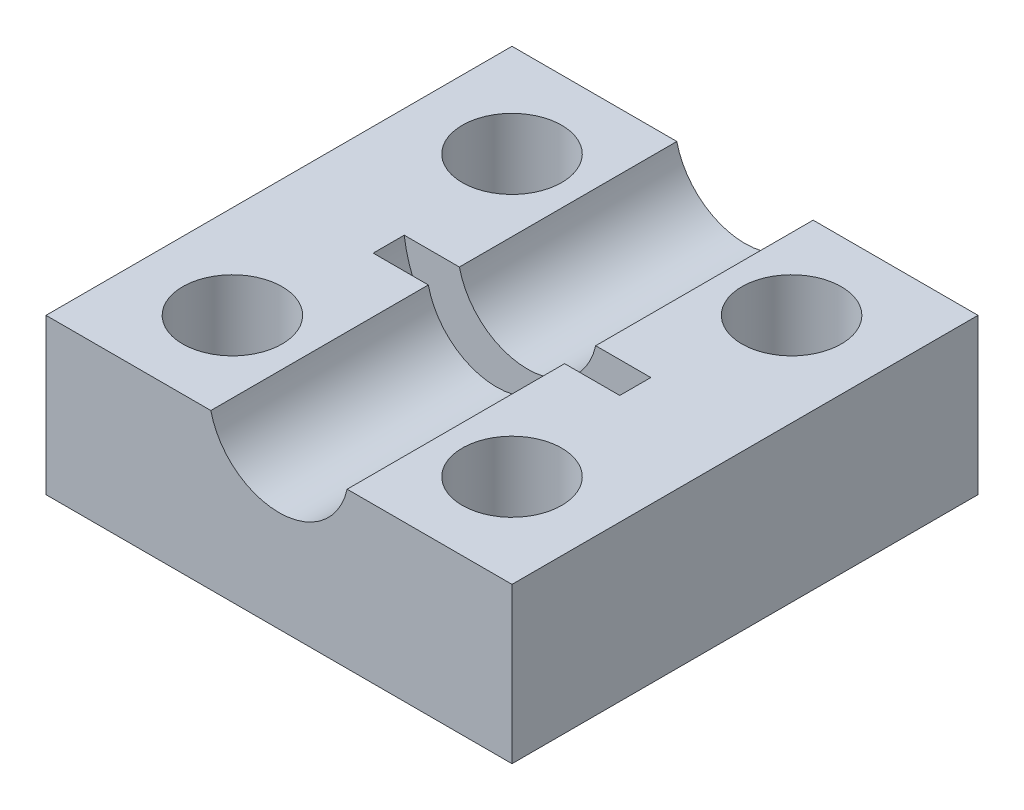
ISO-10303-21;
HEADER;
FILE_DESCRIPTION(('STEP AP214'),'2;1');
FILE_NAME('part.step','',(''),(''),'','','');
FILE_SCHEMA(('AUTOMOTIVE_DESIGN { 1 0 10303 214 1 1 1 1 }'));
ENDSEC;
DATA;
#1=APPLICATION_CONTEXT('core data for automotive mechanical design processes');
#2=APPLICATION_PROTOCOL_DEFINITION('international standard','automotive_design',2000,#1);
#3=PRODUCT_CONTEXT('',#1,'mechanical');
#4=PRODUCT('Part','Part','',(#3));
#5=PRODUCT_RELATED_PRODUCT_CATEGORY('part','',(#4));
#6=PRODUCT_DEFINITION_FORMATION('','',#4);
#7=PRODUCT_DEFINITION_CONTEXT('part definition',#1,'design');
#8=PRODUCT_DEFINITION('design','',#6,#7);
#9=PRODUCT_DEFINITION_SHAPE('','',#8);
#10=(LENGTH_UNIT() NAMED_UNIT(*) SI_UNIT(.MILLI.,.METRE.));
#11=(NAMED_UNIT(*) PLANE_ANGLE_UNIT() SI_UNIT($,.RADIAN.));
#12=(NAMED_UNIT(*) SI_UNIT($,.STERADIAN.) SOLID_ANGLE_UNIT());
#13=UNCERTAINTY_MEASURE_WITH_UNIT(LENGTH_MEASURE(1.E-05),#10,'distance_accuracy_value','');
#14=(GEOMETRIC_REPRESENTATION_CONTEXT(3) GLOBAL_UNCERTAINTY_ASSIGNED_CONTEXT((#13)) GLOBAL_UNIT_ASSIGNED_CONTEXT((#10,
#11,#12)) REPRESENTATION_CONTEXT('',''));
#15=CARTESIAN_POINT('',(0.,0.,0.));
#16=DIRECTION('',(0.,0.,1.));
#17=DIRECTION('',(1.,0.,0.));
#18=AXIS2_PLACEMENT_3D('',#15,#16,#17);
#19=CARTESIAN_POINT('',(0.,5.,0.));
#20=DIRECTION('',(0.,1.,0.));
#21=DIRECTION('',(0.,0.,1.));
#22=AXIS2_PLACEMENT_3D('',#19,#20,#21);
#23=PLANE('',#22);
#24=CARTESIAN_POINT('',(-4.5,5.,4.5));
#25=DIRECTION('',(0.,1.,0.));
#26=DIRECTION('',(0.,0.,1.));
#27=AXIS2_PLACEMENT_3D('',#24,#25,#26);
#28=CIRCLE('',#27,1.6);
#29=CARTESIAN_POINT('',(-4.5,5.,6.1));
#30=VERTEX_POINT('',#29);
#31=EDGE_CURVE('E159',#30,#30,#28,.T.);
#32=ORIENTED_EDGE('',*,*,#31,.F.);
#33=EDGE_LOOP('',(#32));
#34=FACE_BOUND('',#33,.T.);
#35=CARTESIAN_POINT('',(-4.5,5.,-4.5));
#36=DIRECTION('',(0.,1.,0.));
#37=DIRECTION('',(0.,0.,1.));
#38=AXIS2_PLACEMENT_3D('',#35,#36,#37);
#39=CIRCLE('',#38,1.6);
#40=CARTESIAN_POINT('',(-4.5,5.,-2.9));
#41=VERTEX_POINT('',#40);
#42=EDGE_CURVE('E165',#41,#41,#39,.T.);
#43=ORIENTED_EDGE('',*,*,#42,.F.);
#44=EDGE_LOOP('',(#43));
#45=FACE_BOUND('',#44,.T.);
#46=DIRECTION('',(0.,0.,1.));
#47=VECTOR('',#46,1.);
#48=CARTESIAN_POINT('',(-3.96862696659689,5.,-0.500000000000001));
#49=LINE('',#48,#47);
#50=CARTESIAN_POINT('',(-3.96862696659689,5.,-0.500000000000001));
#51=VERTEX_POINT('',#50);
#52=CARTESIAN_POINT('',(-3.96862696659689,5.,0.499999999999999));
#53=VERTEX_POINT('',#52);
#54=EDGE_CURVE('E112',#51,#53,#49,.T.);
#55=ORIENTED_EDGE('',*,*,#54,.F.);
#56=DIRECTION('',(1.,0.,0.));
#57=VECTOR('',#56,1.);
#58=CARTESIAN_POINT('',(0.,5.,-0.500000000000001));
#59=LINE('',#58,#57);
#60=CARTESIAN_POINT('',(-2.19374109684803,5.,-0.500000000000001));
#61=VERTEX_POINT('',#60);
#62=EDGE_CURVE('E121',#51,#61,#59,.T.);
#63=ORIENTED_EDGE('',*,*,#62,.T.);
#64=DIRECTION('',(0.,0.,1.));
#65=VECTOR('',#64,1.);
#66=CARTESIAN_POINT('',(-2.19374109684803,5.,-7.5));
#67=LINE('',#66,#65);
#68=CARTESIAN_POINT('',(-2.19374109684803,5.,-7.5));
#69=VERTEX_POINT('',#68);
#70=EDGE_CURVE('E143',#69,#61,#67,.T.);
#71=ORIENTED_EDGE('',*,*,#70,.F.);
#72=DIRECTION('',(-1.,0.,0.));
#73=VECTOR('',#72,1.);
#74=CARTESIAN_POINT('',(-7.5,5.,-7.5));
#75=LINE('',#74,#73);
#76=CARTESIAN_POINT('',(-7.5,5.,-7.5));
#77=VERTEX_POINT('',#76);
#78=EDGE_CURVE('E174',#69,#77,#75,.T.);
#79=ORIENTED_EDGE('',*,*,#78,.T.);
#80=DIRECTION('',(0.,0.,1.));
#81=VECTOR('',#80,1.);
#82=CARTESIAN_POINT('',(-7.5,5.,-7.5));
#83=LINE('',#82,#81);
#84=CARTESIAN_POINT('',(-7.5,5.,7.5));
#85=VERTEX_POINT('',#84);
#86=EDGE_CURVE('E179',#77,#85,#83,.T.);
#87=ORIENTED_EDGE('',*,*,#86,.T.);
#88=DIRECTION('',(1.,0.,0.));
#89=VECTOR('',#88,1.);
#90=CARTESIAN_POINT('',(-7.5,5.,7.5));
#91=LINE('',#90,#89);
#92=CARTESIAN_POINT('',(-2.19374109684803,5.,7.5));
#93=VERTEX_POINT('',#92);
#94=EDGE_CURVE('E182',#85,#93,#91,.T.);
#95=ORIENTED_EDGE('',*,*,#94,.T.);
#96=CARTESIAN_POINT('',(-2.19374109684803,5.,0.5));
#97=VERTEX_POINT('',#96);
#98=EDGE_CURVE('E56',#97,#93,#67,.T.);
#99=ORIENTED_EDGE('',*,*,#98,.F.);
#100=DIRECTION('',(1.,0.,0.));
#101=VECTOR('',#100,1.);
#102=CARTESIAN_POINT('',(0.,5.,0.499999999999999));
#103=LINE('',#102,#101);
#104=EDGE_CURVE('E49',#53,#97,#103,.T.);
#105=ORIENTED_EDGE('',*,*,#104,.F.);
#106=EDGE_LOOP('',(#55,#63,#71,#79,#87,#95,#99,#105));
#107=FACE_BOUND('',#106,.T.);
#108=ADVANCED_FACE('F34',(#34,#45,#107),#23,.T.);
#109=CARTESIAN_POINT('',(4.5,5.,4.5));
#110=DIRECTION('',(0.,1.,0.));
#111=DIRECTION('',(0.,0.,1.));
#112=AXIS2_PLACEMENT_3D('',#109,#110,#111);
#113=CIRCLE('',#112,1.6);
#114=CARTESIAN_POINT('',(4.5,5.,6.1));
#115=VERTEX_POINT('',#114);
#116=EDGE_CURVE('E153',#115,#115,#113,.T.);
#117=ORIENTED_EDGE('',*,*,#116,.F.);
#118=EDGE_LOOP('',(#117));
#119=FACE_BOUND('',#118,.T.);
#120=CARTESIAN_POINT('',(4.5,5.,-4.5));
#121=DIRECTION('',(0.,1.,0.));
#122=DIRECTION('',(0.,0.,1.));
#123=AXIS2_PLACEMENT_3D('',#120,#121,#122);
#124=CIRCLE('',#123,1.6);
#125=CARTESIAN_POINT('',(4.5,5.,-2.9));
#126=VERTEX_POINT('',#125);
#127=EDGE_CURVE('E147',#126,#126,#124,.T.);
#128=ORIENTED_EDGE('',*,*,#127,.F.);
#129=EDGE_LOOP('',(#128));
#130=FACE_BOUND('',#129,.T.);
#131=DIRECTION('',(0.,0.,1.));
#132=VECTOR('',#131,1.);
#133=CARTESIAN_POINT('',(2.19374109684803,5.,-7.5));
#134=LINE('',#133,#132);
#135=CARTESIAN_POINT('',(2.19374109684803,5.,-0.500000000000001));
#136=VERTEX_POINT('',#135);
#137=CARTESIAN_POINT('',(2.19374109684803,5.,-7.5));
#138=VERTEX_POINT('',#137);
#139=EDGE_CURVE('E138',#136,#138,#134,.F.);
#140=ORIENTED_EDGE('',*,*,#139,.F.);
#141=DIRECTION('',(1.,0.,0.));
#142=VECTOR('',#141,1.);
#143=CARTESIAN_POINT('',(0.,5.,-0.500000000000001));
#144=LINE('',#143,#142);
#145=CARTESIAN_POINT('',(3.96862696659689,5.,-0.500000000000001));
#146=VERTEX_POINT('',#145);
#147=EDGE_CURVE('E128',#136,#146,#144,.T.);
#148=ORIENTED_EDGE('',*,*,#147,.T.);
#149=DIRECTION('',(0.,0.,1.));
#150=VECTOR('',#149,1.);
#151=CARTESIAN_POINT('',(3.96862696659689,5.,-0.500000000000001));
#152=LINE('',#151,#150);
#153=CARTESIAN_POINT('',(3.96862696659689,5.,0.499999999999999));
#154=VERTEX_POINT('',#153);
#155=EDGE_CURVE('E11',#154,#146,#152,.F.);
#156=ORIENTED_EDGE('',*,*,#155,.F.);
#157=DIRECTION('',(1.,0.,0.));
#158=VECTOR('',#157,1.);
#159=CARTESIAN_POINT('',(0.,5.,0.499999999999999));
#160=LINE('',#159,#158);
#161=CARTESIAN_POINT('',(2.19374109684803,5.,0.5));
#162=VERTEX_POINT('',#161);
#163=EDGE_CURVE('E125',#162,#154,#160,.T.);
#164=ORIENTED_EDGE('',*,*,#163,.F.);
#165=CARTESIAN_POINT('',(2.19374109684803,5.,7.5));
#166=VERTEX_POINT('',#165);
#167=EDGE_CURVE('E140',#166,#162,#134,.F.);
#168=ORIENTED_EDGE('',*,*,#167,.F.);
#169=CARTESIAN_POINT('',(7.5,5.,7.5));
#170=VERTEX_POINT('',#169);
#171=EDGE_CURVE('E181',#166,#170,#91,.T.);
#172=ORIENTED_EDGE('',*,*,#171,.T.);
#173=DIRECTION('',(0.,0.,-1.));
#174=VECTOR('',#173,1.);
#175=CARTESIAN_POINT('',(7.5,5.,-7.5));
#176=LINE('',#175,#174);
#177=CARTESIAN_POINT('',(7.5,5.,-7.5));
#178=VERTEX_POINT('',#177);
#179=EDGE_CURVE('E171',#170,#178,#176,.T.);
#180=ORIENTED_EDGE('',*,*,#179,.T.);
#181=EDGE_CURVE('E176',#178,#138,#75,.T.);
#182=ORIENTED_EDGE('',*,*,#181,.T.);
#183=EDGE_LOOP('',(#140,#148,#156,#164,#168,#172,#180,#182));
#184=FACE_BOUND('',#183,.T.);
#185=ADVANCED_FACE('F216',(#119,#130,#184),#23,.T.);
#186=CARTESIAN_POINT('',(0.,5.5,-7.5));
#187=DIRECTION('',(0.,0.,1.));
#188=DIRECTION('',(1.,0.,0.));
#189=AXIS2_PLACEMENT_3D('',#186,#187,#188);
#190=CYLINDRICAL_SURFACE('',#189,2.25);
#191=CARTESIAN_POINT('',(0.,5.5,-0.500000000000001));
#192=DIRECTION('',(0.,0.,1.));
#193=DIRECTION('',(1.,0.,0.));
#194=AXIS2_PLACEMENT_3D('',#191,#192,#193);
#195=CIRCLE('',#194,2.25);
#196=EDGE_CURVE('E42',#136,#61,#195,.F.);
#197=ORIENTED_EDGE('',*,*,#196,.F.);
#198=ORIENTED_EDGE('',*,*,#139,.T.);
#199=CARTESIAN_POINT('',(0.,5.5,-7.5));
#200=DIRECTION('',(0.,0.,1.));
#201=DIRECTION('',(1.,0.,0.));
#202=AXIS2_PLACEMENT_3D('',#199,#200,#201);
#203=CIRCLE('',#202,2.25);
#204=EDGE_CURVE('E135',#69,#138,#203,.T.);
#205=ORIENTED_EDGE('',*,*,#204,.F.);
#206=ORIENTED_EDGE('',*,*,#70,.T.);
#207=EDGE_LOOP('',(#197,#198,#205,#206));
#208=FACE_BOUND('',#207,.T.);
#209=ADVANCED_FACE('F211',(#208),#190,.F.);
#210=CARTESIAN_POINT('',(0.,0.,0.));
#211=DIRECTION('',(0.,1.,0.));
#212=DIRECTION('',(0.,0.,1.));
#213=AXIS2_PLACEMENT_3D('',#210,#211,#212);
#214=PLANE('',#213);
#215=DIRECTION('',(0.,0.,-1.));
#216=VECTOR('',#215,1.);
#217=CARTESIAN_POINT('',(7.5,0.,-7.5));
#218=LINE('',#217,#216);
#219=CARTESIAN_POINT('',(7.5,0.,7.5));
#220=VERTEX_POINT('',#219);
#221=CARTESIAN_POINT('',(7.5,0.,-7.5));
#222=VERTEX_POINT('',#221);
#223=EDGE_CURVE('E168',#220,#222,#218,.T.);
#224=ORIENTED_EDGE('',*,*,#223,.F.);
#225=DIRECTION('',(1.,0.,0.));
#226=VECTOR('',#225,1.);
#227=CARTESIAN_POINT('',(-7.5,0.,7.5));
#228=LINE('',#227,#226);
#229=CARTESIAN_POINT('',(-7.5,0.,7.5));
#230=VERTEX_POINT('',#229);
#231=EDGE_CURVE('E175',#230,#220,#228,.T.);
#232=ORIENTED_EDGE('',*,*,#231,.F.);
#233=DIRECTION('',(0.,0.,1.));
#234=VECTOR('',#233,1.);
#235=CARTESIAN_POINT('',(-7.5,0.,-7.5));
#236=LINE('',#235,#234);
#237=CARTESIAN_POINT('',(-7.5,0.,-7.5));
#238=VERTEX_POINT('',#237);
#239=EDGE_CURVE('E189',#238,#230,#236,.T.);
#240=ORIENTED_EDGE('',*,*,#239,.F.);
#241=DIRECTION('',(-1.,0.,0.));
#242=VECTOR('',#241,1.);
#243=CARTESIAN_POINT('',(-7.5,0.,-7.5));
#244=LINE('',#243,#242);
#245=EDGE_CURVE('E187',#222,#238,#244,.T.);
#246=ORIENTED_EDGE('',*,*,#245,.F.);
#247=EDGE_LOOP('',(#224,#232,#240,#246));
#248=FACE_BOUND('',#247,.T.);
#249=CARTESIAN_POINT('',(-4.5,0.,-4.5));
#250=DIRECTION('',(0.,1.,0.));
#251=DIRECTION('',(0.,0.,1.));
#252=AXIS2_PLACEMENT_3D('',#249,#250,#251);
#253=CIRCLE('',#252,1.6);
#254=CARTESIAN_POINT('',(-4.5,0.,-2.9));
#255=VERTEX_POINT('',#254);
#256=EDGE_CURVE('E162',#255,#255,#253,.T.);
#257=ORIENTED_EDGE('',*,*,#256,.T.);
#258=EDGE_LOOP('',(#257));
#259=FACE_BOUND('',#258,.T.);
#260=CARTESIAN_POINT('',(-4.5,0.,4.5));
#261=DIRECTION('',(0.,1.,0.));
#262=DIRECTION('',(0.,0.,1.));
#263=AXIS2_PLACEMENT_3D('',#260,#261,#262);
#264=CIRCLE('',#263,1.6);
#265=CARTESIAN_POINT('',(-4.5,0.,6.1));
#266=VERTEX_POINT('',#265);
#267=EDGE_CURVE('E156',#266,#266,#264,.T.);
#268=ORIENTED_EDGE('',*,*,#267,.T.);
#269=EDGE_LOOP('',(#268));
#270=FACE_BOUND('',#269,.T.);
#271=CARTESIAN_POINT('',(4.5,0.,4.5));
#272=DIRECTION('',(0.,1.,0.));
#273=DIRECTION('',(0.,0.,1.));
#274=AXIS2_PLACEMENT_3D('',#271,#272,#273);
#275=CIRCLE('',#274,1.6);
#276=CARTESIAN_POINT('',(4.5,0.,6.1));
#277=VERTEX_POINT('',#276);
#278=EDGE_CURVE('E150',#277,#277,#275,.T.);
#279=ORIENTED_EDGE('',*,*,#278,.T.);
#280=EDGE_LOOP('',(#279));
#281=FACE_BOUND('',#280,.T.);
#282=CARTESIAN_POINT('',(4.5,0.,-4.5));
#283=DIRECTION('',(0.,1.,0.));
#284=DIRECTION('',(0.,0.,1.));
#285=AXIS2_PLACEMENT_3D('',#282,#283,#284);
#286=CIRCLE('',#285,1.6);
#287=CARTESIAN_POINT('',(4.5,0.,-2.9));
#288=VERTEX_POINT('',#287);
#289=EDGE_CURVE('E146',#288,#288,#286,.T.);
#290=ORIENTED_EDGE('',*,*,#289,.T.);
#291=EDGE_LOOP('',(#290));
#292=FACE_BOUND('',#291,.T.);
#293=ADVANCED_FACE('F231',(#248,#259,#270,#281,#292),#214,.F.);
#294=CARTESIAN_POINT('',(7.5,5.,-7.5));
#295=DIRECTION('',(-1.,0.,0.));
#296=DIRECTION('',(0.,0.,1.));
#297=AXIS2_PLACEMENT_3D('',#294,#295,#296);
#298=PLANE('',#297);
#299=ORIENTED_EDGE('',*,*,#223,.T.);
#300=DIRECTION('',(0.,-1.,0.));
#301=VECTOR('',#300,1.);
#302=CARTESIAN_POINT('',(7.5,5.,-7.5));
#303=LINE('',#302,#301);
#304=EDGE_CURVE('E200',#178,#222,#303,.T.);
#305=ORIENTED_EDGE('',*,*,#304,.F.);
#306=ORIENTED_EDGE('',*,*,#179,.F.);
#307=DIRECTION('',(0.,-1.,0.));
#308=VECTOR('',#307,1.);
#309=CARTESIAN_POINT('',(7.5,5.,7.5));
#310=LINE('',#309,#308);
#311=EDGE_CURVE('E184',#170,#220,#310,.T.);
#312=ORIENTED_EDGE('',*,*,#311,.T.);
#313=EDGE_LOOP('',(#299,#305,#306,#312));
#314=FACE_BOUND('',#313,.T.);
#315=ADVANCED_FACE('F36',(#314),#298,.F.);
#316=CARTESIAN_POINT('',(-7.5,5.,-7.5));
#317=DIRECTION('',(0.,0.,1.));
#318=DIRECTION('',(1.,0.,0.));
#319=AXIS2_PLACEMENT_3D('',#316,#317,#318);
#320=PLANE('',#319);
#321=ORIENTED_EDGE('',*,*,#78,.F.);
#322=ORIENTED_EDGE('',*,*,#204,.T.);
#323=ORIENTED_EDGE('',*,*,#181,.F.);
#324=ORIENTED_EDGE('',*,*,#304,.T.);
#325=ORIENTED_EDGE('',*,*,#245,.T.);
#326=DIRECTION('',(0.,-1.,0.));
#327=VECTOR('',#326,1.);
#328=CARTESIAN_POINT('',(-7.5,5.,-7.5));
#329=LINE('',#328,#327);
#330=EDGE_CURVE('E197',#77,#238,#329,.T.);
#331=ORIENTED_EDGE('',*,*,#330,.F.);
#332=EDGE_LOOP('',(#321,#322,#323,#324,#325,#331));
#333=FACE_BOUND('',#332,.T.);
#334=ADVANCED_FACE('F213',(#333),#320,.F.);
#335=CARTESIAN_POINT('',(-7.5,5.,-7.5));
#336=DIRECTION('',(1.,0.,0.));
#337=DIRECTION('',(0.,0.,-1.));
#338=AXIS2_PLACEMENT_3D('',#335,#336,#337);
#339=PLANE('',#338);
#340=ORIENTED_EDGE('',*,*,#239,.T.);
#341=DIRECTION('',(0.,-1.,0.));
#342=VECTOR('',#341,1.);
#343=CARTESIAN_POINT('',(-7.5,5.,7.5));
#344=LINE('',#343,#342);
#345=EDGE_CURVE('E194',#85,#230,#344,.T.);
#346=ORIENTED_EDGE('',*,*,#345,.F.);
#347=ORIENTED_EDGE('',*,*,#86,.F.);
#348=ORIENTED_EDGE('',*,*,#330,.T.);
#349=EDGE_LOOP('',(#340,#346,#347,#348));
#350=FACE_BOUND('',#349,.T.);
#351=ADVANCED_FACE('F228',(#350),#339,.F.);
#352=CARTESIAN_POINT('',(-7.5,5.,7.5));
#353=DIRECTION('',(0.,0.,-1.));
#354=DIRECTION('',(-1.,0.,0.));
#355=AXIS2_PLACEMENT_3D('',#352,#353,#354);
#356=PLANE('',#355);
#357=ORIENTED_EDGE('',*,*,#171,.F.);
#358=CARTESIAN_POINT('',(0.,5.5,7.5));
#359=DIRECTION('',(0.,0.,1.));
#360=DIRECTION('',(1.,0.,0.));
#361=AXIS2_PLACEMENT_3D('',#358,#359,#360);
#362=CIRCLE('',#361,2.25);
#363=EDGE_CURVE('E120',#93,#166,#362,.T.);
#364=ORIENTED_EDGE('',*,*,#363,.F.);
#365=ORIENTED_EDGE('',*,*,#94,.F.);
#366=ORIENTED_EDGE('',*,*,#345,.T.);
#367=ORIENTED_EDGE('',*,*,#231,.T.);
#368=ORIENTED_EDGE('',*,*,#311,.F.);
#369=EDGE_LOOP('',(#357,#364,#365,#366,#367,#368));
#370=FACE_BOUND('',#369,.T.);
#371=ADVANCED_FACE('F234',(#370),#356,.F.);
#372=CARTESIAN_POINT('',(-4.5,5.,-4.5));
#373=DIRECTION('',(0.,-1.,0.));
#374=DIRECTION('',(0.,0.,-1.));
#375=AXIS2_PLACEMENT_3D('',#372,#373,#374);
#376=CYLINDRICAL_SURFACE('',#375,1.6);
#377=ORIENTED_EDGE('',*,*,#42,.T.);
#378=EDGE_LOOP('',(#377));
#379=FACE_BOUND('',#378,.T.);
#380=ORIENTED_EDGE('',*,*,#256,.F.);
#381=EDGE_LOOP('',(#380));
#382=FACE_BOUND('',#381,.T.);
#383=ADVANCED_FACE('F261',(#379,#382),#376,.F.);
#384=CARTESIAN_POINT('',(-4.5,5.,4.5));
#385=DIRECTION('',(0.,-1.,0.));
#386=DIRECTION('',(0.,0.,-1.));
#387=AXIS2_PLACEMENT_3D('',#384,#385,#386);
#388=CYLINDRICAL_SURFACE('',#387,1.6);
#389=ORIENTED_EDGE('',*,*,#31,.T.);
#390=EDGE_LOOP('',(#389));
#391=FACE_BOUND('',#390,.T.);
#392=ORIENTED_EDGE('',*,*,#267,.F.);
#393=EDGE_LOOP('',(#392));
#394=FACE_BOUND('',#393,.T.);
#395=ADVANCED_FACE('F321',(#391,#394),#388,.F.);
#396=CARTESIAN_POINT('',(4.5,5.,4.5));
#397=DIRECTION('',(0.,-1.,0.));
#398=DIRECTION('',(0.,0.,-1.));
#399=AXIS2_PLACEMENT_3D('',#396,#397,#398);
#400=CYLINDRICAL_SURFACE('',#399,1.6);
#401=ORIENTED_EDGE('',*,*,#116,.T.);
#402=EDGE_LOOP('',(#401));
#403=FACE_BOUND('',#402,.T.);
#404=ORIENTED_EDGE('',*,*,#278,.F.);
#405=EDGE_LOOP('',(#404));
#406=FACE_BOUND('',#405,.T.);
#407=ADVANCED_FACE('F246',(#403,#406),#400,.F.);
#408=CARTESIAN_POINT('',(4.5,5.,-4.5));
#409=DIRECTION('',(0.,-1.,0.));
#410=DIRECTION('',(0.,0.,-1.));
#411=AXIS2_PLACEMENT_3D('',#408,#409,#410);
#412=CYLINDRICAL_SURFACE('',#411,1.6);
#413=ORIENTED_EDGE('',*,*,#127,.T.);
#414=EDGE_LOOP('',(#413));
#415=FACE_BOUND('',#414,.T.);
#416=ORIENTED_EDGE('',*,*,#289,.F.);
#417=EDGE_LOOP('',(#416));
#418=FACE_BOUND('',#417,.T.);
#419=ADVANCED_FACE('F239',(#415,#418),#412,.F.);
#420=ORIENTED_EDGE('',*,*,#167,.T.);
#421=CARTESIAN_POINT('',(0.,5.5,0.5));
#422=DIRECTION('',(0.,0.,1.));
#423=DIRECTION('',(1.,0.,0.));
#424=AXIS2_PLACEMENT_3D('',#421,#422,#423);
#425=CIRCLE('',#424,2.25);
#426=EDGE_CURVE('E203',#162,#97,#425,.F.);
#427=ORIENTED_EDGE('',*,*,#426,.T.);
#428=ORIENTED_EDGE('',*,*,#98,.T.);
#429=ORIENTED_EDGE('',*,*,#363,.T.);
#430=EDGE_LOOP('',(#420,#427,#428,#429));
#431=FACE_BOUND('',#430,.T.);
#432=ADVANCED_FACE('F236',(#431),#190,.F.);
#433=CARTESIAN_POINT('',(0.,5.5,-0.500000000000001));
#434=DIRECTION('',(0.,0.,1.));
#435=DIRECTION('',(1.,0.,0.));
#436=AXIS2_PLACEMENT_3D('',#433,#434,#435);
#437=CYLINDRICAL_SURFACE('',#436,4.);
#438=ORIENTED_EDGE('',*,*,#54,.T.);
#439=CARTESIAN_POINT('',(0.,5.5,0.499999999999999));
#440=DIRECTION('',(0.,0.,1.));
#441=DIRECTION('',(1.,0.,0.));
#442=AXIS2_PLACEMENT_3D('',#439,#440,#441);
#443=CIRCLE('',#442,4.);
#444=EDGE_CURVE('E114',#53,#154,#443,.T.);
#445=ORIENTED_EDGE('',*,*,#444,.T.);
#446=ORIENTED_EDGE('',*,*,#155,.T.);
#447=CARTESIAN_POINT('',(0.,5.5,-0.500000000000001));
#448=DIRECTION('',(0.,0.,1.));
#449=DIRECTION('',(1.,0.,0.));
#450=AXIS2_PLACEMENT_3D('',#447,#448,#449);
#451=CIRCLE('',#450,4.);
#452=EDGE_CURVE('E117',#51,#146,#451,.T.);
#453=ORIENTED_EDGE('',*,*,#452,.F.);
#454=EDGE_LOOP('',(#438,#445,#446,#453));
#455=FACE_BOUND('',#454,.T.);
#456=ADVANCED_FACE('F113',(#455),#437,.F.);
#457=CARTESIAN_POINT('',(0.,5.5,-0.500000000000001));
#458=DIRECTION('',(0.,0.,1.));
#459=DIRECTION('',(1.,0.,0.));
#460=AXIS2_PLACEMENT_3D('',#457,#458,#459);
#461=PLANE('',#460);
#462=ORIENTED_EDGE('',*,*,#452,.T.);
#463=ORIENTED_EDGE('',*,*,#147,.F.);
#464=ORIENTED_EDGE('',*,*,#196,.T.);
#465=ORIENTED_EDGE('',*,*,#62,.F.);
#466=EDGE_LOOP('',(#462,#463,#464,#465));
#467=FACE_BOUND('',#466,.T.);
#468=ADVANCED_FACE('F206',(#467),#461,.T.);
#469=CARTESIAN_POINT('',(0.,5.5,0.499999999999999));
#470=DIRECTION('',(0.,0.,1.));
#471=DIRECTION('',(1.,0.,0.));
#472=AXIS2_PLACEMENT_3D('',#469,#470,#471);
#473=PLANE('',#472);
#474=ORIENTED_EDGE('',*,*,#104,.T.);
#475=ORIENTED_EDGE('',*,*,#426,.F.);
#476=ORIENTED_EDGE('',*,*,#163,.T.);
#477=ORIENTED_EDGE('',*,*,#444,.F.);
#478=EDGE_LOOP('',(#474,#475,#476,#477));
#479=FACE_BOUND('',#478,.T.);
#480=ADVANCED_FACE('F123',(#479),#473,.F.);
#481=CLOSED_SHELL('',(#108,#185,#209,#293,#315,#334,#351,#371,#383,#395,#407,#419,#432,#456,
#468,#480));
#482=MANIFOLD_SOLID_BREP('B2',#481);
#483=ADVANCED_BREP_SHAPE_REPRESENTATION('',(#18,#482),#14);
#484=SHAPE_DEFINITION_REPRESENTATION(#9,#483);
ENDSEC;
END-ISO-10303-21;
